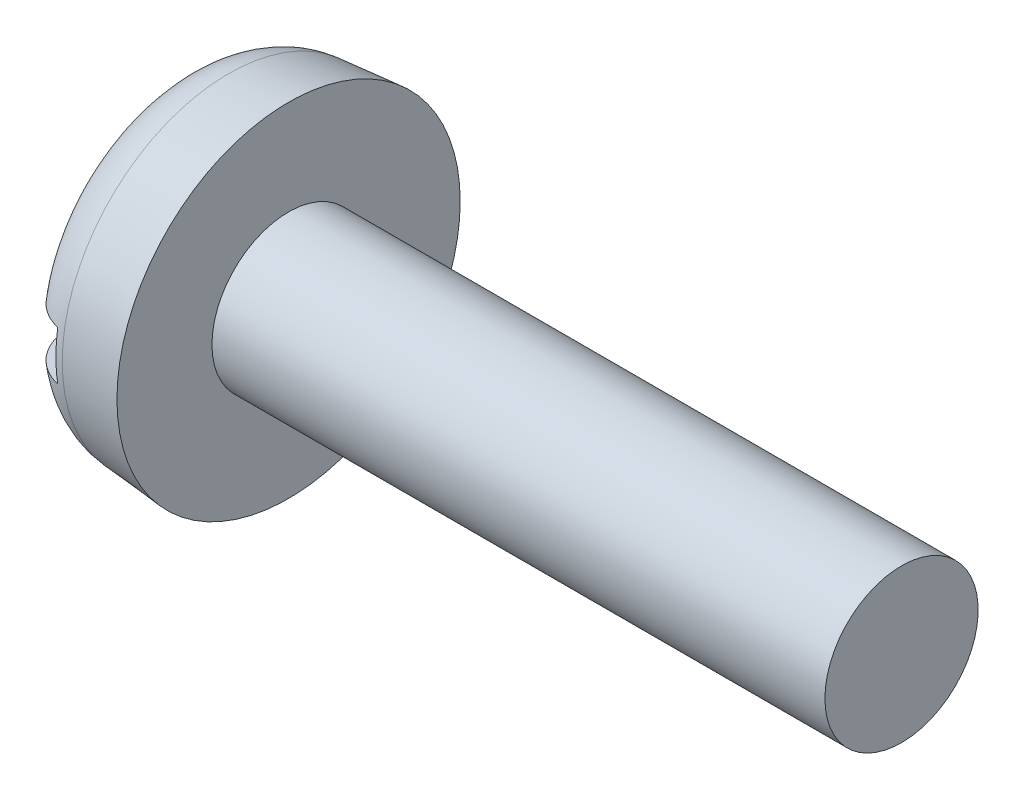
ISO-10303-21;
HEADER;
FILE_DESCRIPTION(('STEP AP214'),'2;1');
FILE_NAME('part.step','',(''),(''),'','','');
FILE_SCHEMA(('AUTOMOTIVE_DESIGN { 1 0 10303 214 1 1 1 1 }'));
ENDSEC;
DATA;
#1=APPLICATION_CONTEXT('core data for automotive mechanical design processes');
#2=APPLICATION_PROTOCOL_DEFINITION('international standard','automotive_design',2000,#1);
#3=PRODUCT_CONTEXT('',#1,'mechanical');
#4=PRODUCT('Part','Part','',(#3));
#5=PRODUCT_RELATED_PRODUCT_CATEGORY('part','',(#4));
#6=PRODUCT_DEFINITION_FORMATION('','',#4);
#7=PRODUCT_DEFINITION_CONTEXT('part definition',#1,'design');
#8=PRODUCT_DEFINITION('design','',#6,#7);
#9=PRODUCT_DEFINITION_SHAPE('','',#8);
#10=(LENGTH_UNIT() NAMED_UNIT(*) SI_UNIT(.MILLI.,.METRE.));
#11=(NAMED_UNIT(*) PLANE_ANGLE_UNIT() SI_UNIT($,.RADIAN.));
#12=(NAMED_UNIT(*) SI_UNIT($,.STERADIAN.) SOLID_ANGLE_UNIT());
#13=UNCERTAINTY_MEASURE_WITH_UNIT(LENGTH_MEASURE(1.E-05),#10,'distance_accuracy_value','');
#14=(GEOMETRIC_REPRESENTATION_CONTEXT(3) GLOBAL_UNCERTAINTY_ASSIGNED_CONTEXT((#13)) GLOBAL_UNIT_ASSIGNED_CONTEXT((#10,
#11,#12)) REPRESENTATION_CONTEXT('',''));
#15=CARTESIAN_POINT('',(0.,0.,0.));
#16=DIRECTION('',(0.,0.,1.));
#17=DIRECTION('',(1.,0.,0.));
#18=AXIS2_PLACEMENT_3D('',#15,#16,#17);
#19=CARTESIAN_POINT('',(0.,0.,0.));
#20=DIRECTION('',(-1.,0.,0.));
#21=DIRECTION('',(0.,0.,1.));
#22=AXIS2_PLACEMENT_3D('',#19,#20,#21);
#23=PLANE('',#22);
#24=DIRECTION('',(0.,0.,-1.));
#25=VECTOR('',#24,1.);
#26=CARTESIAN_POINT('',(0.,0.399999999999999,2.8));
#27=LINE('',#26,#25);
#28=CARTESIAN_POINT('',(0.,0.399999999999999,1.77326763142532));
#29=VERTEX_POINT('',#28);
#30=CARTESIAN_POINT('',(0.,0.399999999999999,-1.77326763142532));
#31=VERTEX_POINT('',#30);
#32=EDGE_CURVE('E90',#29,#31,#27,.T.);
#33=ORIENTED_EDGE('',*,*,#32,.F.);
#34=CARTESIAN_POINT('',(0.,0.,0.));
#35=DIRECTION('',(-1.,0.,0.));
#36=DIRECTION('',(0.,0.,1.));
#37=AXIS2_PLACEMENT_3D('',#34,#35,#36);
#38=CIRCLE('',#37,1.81782234903766);
#39=EDGE_CURVE('E96',#29,#31,#38,.T.);
#40=ORIENTED_EDGE('',*,*,#39,.T.);
#41=EDGE_LOOP('',(#33,#40));
#42=FACE_BOUND('',#41,.T.);
#43=ADVANCED_FACE('F37',(#42),#23,.T.);
#44=CARTESIAN_POINT('',(-25.4,0.,0.));
#45=DIRECTION('',(-1.,0.,0.));
#46=DIRECTION('',(0.,0.,1.));
#47=AXIS2_PLACEMENT_3D('',#44,#45,#46);
#48=CYLINDRICAL_SURFACE('',#47,1.25);
#49=CARTESIAN_POINT('',(11.8,0.,0.));
#50=DIRECTION('',(-1.,0.,0.));
#51=DIRECTION('',(0.,0.,1.));
#52=AXIS2_PLACEMENT_3D('',#49,#50,#51);
#53=CIRCLE('',#52,1.25);
#54=CARTESIAN_POINT('',(11.8,0.,1.25));
#55=VERTEX_POINT('',#54);
#56=EDGE_CURVE('E97',#55,#55,#53,.T.);
#57=ORIENTED_EDGE('',*,*,#56,.T.);
#58=EDGE_LOOP('',(#57));
#59=FACE_BOUND('',#58,.T.);
#60=CARTESIAN_POINT('',(1.8,0.,0.));
#61=DIRECTION('',(-1.,0.,0.));
#62=DIRECTION('',(0.,0.,1.));
#63=AXIS2_PLACEMENT_3D('',#60,#61,#62);
#64=CIRCLE('',#63,1.25);
#65=CARTESIAN_POINT('',(1.8,0.,1.25));
#66=VERTEX_POINT('',#65);
#67=EDGE_CURVE('E154',#66,#66,#64,.T.);
#68=ORIENTED_EDGE('',*,*,#67,.F.);
#69=EDGE_LOOP('',(#68));
#70=FACE_BOUND('',#69,.T.);
#71=ADVANCED_FACE('F142',(#59,#70),#48,.T.);
#72=CARTESIAN_POINT('',(11.8,1.25,0.));
#73=DIRECTION('',(1.,0.,0.));
#74=DIRECTION('',(0.,0.,-1.));
#75=AXIS2_PLACEMENT_3D('',#72,#73,#74);
#76=PLANE('',#75);
#77=ORIENTED_EDGE('',*,*,#56,.F.);
#78=EDGE_LOOP('',(#77));
#79=FACE_BOUND('',#78,.T.);
#80=ADVANCED_FACE('F140',(#79),#76,.T.);
#81=DIRECTION('',(0.,0.,1.));
#82=VECTOR('',#81,1.);
#83=CARTESIAN_POINT('',(0.,-0.4,-2.8));
#84=LINE('',#83,#82);
#85=CARTESIAN_POINT('',(0.,-0.4,-1.77326763142532));
#86=VERTEX_POINT('',#85);
#87=CARTESIAN_POINT('',(0.,-0.4,1.77326763142532));
#88=VERTEX_POINT('',#87);
#89=EDGE_CURVE('E81',#86,#88,#84,.T.);
#90=ORIENTED_EDGE('',*,*,#89,.F.);
#91=EDGE_CURVE('E88',#86,#88,#38,.T.);
#92=ORIENTED_EDGE('',*,*,#91,.T.);
#93=EDGE_LOOP('',(#90,#92));
#94=FACE_BOUND('',#93,.T.);
#95=ADVANCED_FACE('F87',(#94),#23,.T.);
#96=CARTESIAN_POINT('',(0.,0.,0.));
#97=DIRECTION('',(1.,0.,0.));
#98=DIRECTION('',(0.,0.,-1.));
#99=AXIS2_PLACEMENT_3D('',#96,#97,#98);
#100=CONICAL_SURFACE('',#99,2.64252040565334,0.087266462599717);
#101=CARTESIAN_POINT('',(0.821559831527107,0.,0.));
#102=DIRECTION('',(-1.,0.,0.));
#103=DIRECTION('',(0.,0.,1.));
#104=AXIS2_PLACEMENT_3D('',#101,#102,#103);
#105=CIRCLE('',#104,2.71439757732023);
#106=CARTESIAN_POINT('',(0.821559831527107,0.,2.71439757732023));
#107=VERTEX_POINT('',#106);
#108=EDGE_CURVE('E100',#107,#107,#105,.F.);
#109=ORIENTED_EDGE('',*,*,#108,.T.);
#110=EDGE_LOOP('',(#109));
#111=FACE_BOUND('',#110,.T.);
#112=CARTESIAN_POINT('',(1.8,0.,0.));
#113=DIRECTION('',(-1.,0.,0.));
#114=DIRECTION('',(0.,0.,1.));
#115=AXIS2_PLACEMENT_3D('',#112,#113,#114);
#116=CIRCLE('',#115,2.8);
#117=CARTESIAN_POINT('',(1.8,0.,2.8));
#118=VERTEX_POINT('',#117);
#119=EDGE_CURVE('E102',#118,#118,#116,.T.);
#120=ORIENTED_EDGE('',*,*,#119,.T.);
#121=EDGE_LOOP('',(#120));
#122=FACE_BOUND('',#121,.T.);
#123=ADVANCED_FACE('F133',(#111,#122),#100,.T.);
#124=CARTESIAN_POINT('',(1.8,1.25,0.));
#125=DIRECTION('',(-1.,0.,0.));
#126=DIRECTION('',(0.,0.,1.));
#127=AXIS2_PLACEMENT_3D('',#124,#125,#126);
#128=PLANE('',#127);
#129=ORIENTED_EDGE('',*,*,#119,.F.);
#130=EDGE_LOOP('',(#129));
#131=FACE_BOUND('',#130,.T.);
#132=ORIENTED_EDGE('',*,*,#67,.T.);
#133=EDGE_LOOP('',(#132));
#134=FACE_BOUND('',#133,.T.);
#135=ADVANCED_FACE('F129',(#131,#134),#128,.F.);
#136=CARTESIAN_POINT('',(0.9,0.,0.));
#137=DIRECTION('',(-1.,0.,0.));
#138=DIRECTION('',(0.,0.,1.));
#139=AXIS2_PLACEMENT_3D('',#136,#137,#138);
#140=TOROIDAL_SURFACE('',#139,1.81782234903766,0.9);
#141=CARTESIAN_POINT('',(0.285780762477817,0.399999999999999,-2.44311963508101));
#142=CARTESIAN_POINT('',(0.322325244969282,0.399999999999999,-2.47769297217772));
#143=CARTESIAN_POINT('',(0.361794878156767,0.399999999999999,-2.50922544126929));
#144=CARTESIAN_POINT('',(0.445493757535042,0.399999999999999,-2.56525291577746));
#145=CARTESIAN_POINT('',(0.48972822484029,0.399999999999999,-2.58974009118149));
#146=CARTESIAN_POINT('',(0.581685294636184,0.399999999999999,-2.63091846199156));
#147=CARTESIAN_POINT('',(0.629407305379897,0.399999999999999,-2.64761097641683));
#148=CARTESIAN_POINT('',(0.726972312257168,0.399999999999999,-2.67270033258514));
#149=CARTESIAN_POINT('',(0.776814803129367,0.399999999999999,-2.68109913910669));
#150=CARTESIAN_POINT('',(0.876977038697278,0.399999999999999,-2.68933922206438));
#151=CARTESIAN_POINT('',(0.92729364560996,0.399999999999999,-2.68921866149007));
#152=CARTESIAN_POINT('',(1.02719093347253,0.399999999999999,-2.68051830929739));
#153=CARTESIAN_POINT('',(1.07677160162593,0.399999999999999,-2.67193837076201));
#154=CARTESIAN_POINT('',(1.17371760664879,0.399999999999999,-2.6465919807109));
#155=CARTESIAN_POINT('',(1.2210859954371,0.399999999999999,-2.62983719558013));
#156=CARTESIAN_POINT('',(1.31235127069059,0.399999999999999,-2.58864040768255));
#157=CARTESIAN_POINT('',(1.35624813968071,0.399999999999999,-2.56419836622246));
#158=CARTESIAN_POINT('',(1.43950339303332,0.399999999999999,-2.50824069345436));
#159=CARTESIAN_POINT('',(1.47884484993389,0.399999999999999,-2.47669988555644));
#160=CARTESIAN_POINT('',(1.55173067508121,0.399999999999999,-2.40751412200212));
#161=CARTESIAN_POINT('',(1.5852748745774,0.399999999999999,-2.36986898871862));
#162=CARTESIAN_POINT('',(1.64594872274809,0.399999999999999,-2.28919528368316));
#163=CARTESIAN_POINT('',(1.67301846569636,0.399999999999999,-2.24612167422176));
#164=CARTESIAN_POINT('',(1.71966197411636,0.399999999999999,-2.15609376898817));
#165=CARTESIAN_POINT('',(1.73923530584546,0.399999999999999,-2.10913924885738));
#166=CARTESIAN_POINT('',(1.77066025907209,0.399999999999999,-2.01194193646076));
#167=CARTESIAN_POINT('',(1.78239254664628,0.399999999999999,-1.96166058810882));
#168=CARTESIAN_POINT('',(1.7974373595853,0.399999999999999,-1.85985639013623));
#169=CARTESIAN_POINT('',(1.80074908437145,0.399999999999999,-1.80833342293966));
#170=CARTESIAN_POINT('',(1.79894832980293,0.399999999999999,-1.70434405475568));
#171=CARTESIAN_POINT('',(1.79365584590562,0.399999999999999,-1.651880798299));
#172=CARTESIAN_POINT('',(1.77456092354076,0.399999999999999,-1.54852841034414));
#173=CARTESIAN_POINT('',(1.76075741543224,0.399999999999999,-1.49763947754675));
#174=CARTESIAN_POINT('',(1.7246504916629,0.399999999999999,-1.3975266769579));
#175=CARTESIAN_POINT('',(1.70214283236717,0.399999999999999,-1.34837644263265));
#176=CARTESIAN_POINT('',(1.64933120824444,0.399999999999999,-1.25444995564252));
#177=CARTESIAN_POINT('',(1.6190255468442,0.399999999999999,-1.20967465773975));
#178=CARTESIAN_POINT('',(1.55085214424215,0.399999999999999,-1.12504927254803));
#179=CARTESIAN_POINT('',(1.51286662510254,0.399999999999999,-1.08529386793689));
#180=CARTESIAN_POINT('',(1.4306134165613,0.399999999999999,-1.01288372669285));
#181=CARTESIAN_POINT('',(1.38634513970435,0.399999999999999,-0.980229654778111));
#182=CARTESIAN_POINT('',(1.29378824575784,0.399999999999999,-0.924048107397016));
#183=CARTESIAN_POINT('',(1.24562231583718,0.399999999999999,-0.900319541839471));
#184=CARTESIAN_POINT('',(1.14574424072186,0.399999999999999,-0.862177327128566));
#185=CARTESIAN_POINT('',(1.09403573066562,0.399999999999999,-0.847754283110135));
#186=CARTESIAN_POINT('',(0.993395643106034,0.399999999999999,-0.830011922353259));
#187=CARTESIAN_POINT('',(0.944615271160062,0.399999999999999,-0.825833796085957));
#188=CARTESIAN_POINT('',(0.847107354416666,0.399999999999999,-0.826334878356685));
#189=CARTESIAN_POINT('',(0.798379798268946,0.399999999999999,-0.831011470142969));
#190=CARTESIAN_POINT('',(0.705495670608723,0.399999999999999,-0.848340731069384));
#191=CARTESIAN_POINT('',(0.661242330843084,0.399999999999999,-0.860484898174224));
#192=CARTESIAN_POINT('',(0.575232402842408,0.399999999999999,-0.891650416332973));
#193=CARTESIAN_POINT('',(0.53347652813922,0.399999999999999,-0.910673721938904));
#194=CARTESIAN_POINT('',(0.451191926076945,0.399999999999999,-0.956010770911779));
#195=CARTESIAN_POINT('',(0.410848958567061,0.399999999999999,-0.982660648611481));
#196=CARTESIAN_POINT('',(0.334722321142852,0.399999999999999,-1.04182188589593));
#197=CARTESIAN_POINT('',(0.298940164912518,0.399999999999999,-1.0743351828853));
#198=CARTESIAN_POINT('',(0.229649980616187,0.399999999999999,-1.14749226888793));
#199=CARTESIAN_POINT('',(0.19663491483028,0.399999999999999,-1.18860403936715));
#200=CARTESIAN_POINT('',(0.137645150810003,0.399999999999999,-1.27560624817727));
#201=CARTESIAN_POINT('',(0.111672172806046,0.399999999999999,-1.32149785033543));
#202=CARTESIAN_POINT('',(0.0665593590158845,0.399999999999999,-1.41881690272049));
#203=CARTESIAN_POINT('',(0.0477401615322295,0.399999999999999,-1.47039354331754));
#204=CARTESIAN_POINT('',(0.0191028447664949,0.399999999999999,-1.57598967955257));
#205=CARTESIAN_POINT('',(0.0092842991143383,0.399999999999999,-1.63000905934828));
#206=CARTESIAN_POINT('',(-0.000908845669418229,0.399999999999999,-1.73850050809585));
#207=CARTESIAN_POINT('',(-0.00135843890630432,0.399999999999999,-1.7929654882335));
#208=CARTESIAN_POINT('',(0.00713794868793661,0.399999999999999,-1.90117587148683));
#209=CARTESIAN_POINT('',(0.0160852351491477,0.399999999999999,-1.9549211735574));
#210=CARTESIAN_POINT('',(0.0428869469078851,0.399999999999999,-2.05874477252473));
#211=CARTESIAN_POINT('',(0.0605196216319729,0.399999999999999,-2.10888044427302));
#212=CARTESIAN_POINT('',(0.104140493725079,0.399999999999999,-2.20532358851202));
#213=CARTESIAN_POINT('',(0.130117020588857,0.399999999999999,-2.25163629510255));
#214=CARTESIAN_POINT('',(0.178150945787741,0.399999999999999,-2.32211375046635));
#215=CARTESIAN_POINT('',(0.197843641859489,0.399999999999999,-2.34792122195273));
#216=CARTESIAN_POINT('',(0.239879292580621,0.399999999999999,-2.39728022756983));
#217=CARTESIAN_POINT('',(0.26222221206527,0.399999999999999,-2.42083179162577));
#218=CARTESIAN_POINT('',(0.285780762477817,0.399999999999999,-2.44311963508101));
#219=B_SPLINE_CURVE_WITH_KNOTS('',3,(#141,#142,#143,#144,#145,#146,#147,#148,#149,#150,#151,
#152,#153,#154,#155,#156,#157,#158,#159,#160,#161,#162,#163,#164,#165,#166,#167,#168,#169,#170,
#171,#172,#173,#174,#175,#176,#177,#178,#179,#180,#181,#182,#183,#184,#185,#186,#187,#188,#189,
#190,#191,#192,#193,#194,#195,#196,#197,#198,#199,#200,#201,#202,#203,#204,#205,#206,#207,#208,
#209,#210,#211,#212,#213,#214,#215,#216,#217,#218),.UNSPECIFIED.,.T.,.F.,(4,2,2,2,2,2,2,2,2,2,2,
2,2,2,2,2,2,2,2,2,2,2,2,2,2,2,2,2,2,2,2,2,2,2,2,2,2,2,4),(0.,0.15080428220943,0.301775523831159,
0.452721208703323,0.603631125974155,0.753865076726384,0.904101636690626,1.05412441728995,
1.2041479530309,1.35471219197995,1.50528081291863,1.65719291262943,1.80911380065295,
1.96329712022902,2.11749509812026,2.27496068670365,2.43244606914274,2.59387611122166,
2.75534130458713,2.9195015653164,3.08367718561128,3.24389389244898,3.40394859014677,
3.55004213794101,3.69609251881818,3.83315592967566,3.97025831464733,4.11470991133513,
4.25920932580005,4.41668805635775,4.57420522099047,4.73812462607052,4.90203626571949,
5.06463536051201,5.22725705028985,5.38592661841767,5.54437521558828,5.64159310397338,
5.73880970255809),.UNSPECIFIED.);
#220=CARTESIAN_POINT('',(0.7,0.399999999999999,-2.66547244738019));
#221=VERTEX_POINT('',#220);
#222=EDGE_CURVE('E11',#31,#221,#219,.T.);
#223=ORIENTED_EDGE('',*,*,#222,.F.);
#224=ORIENTED_EDGE('',*,*,#39,.F.);
#225=CARTESIAN_POINT('',(0.356169071138296,0.399999999999999,1.02545886384317));
#226=CARTESIAN_POINT('',(0.394477383289829,0.399999999999999,0.994276095963573));
#227=CARTESIAN_POINT('',(0.435252098816795,0.399999999999999,0.966090537778846));
#228=CARTESIAN_POINT('',(0.520874070068605,0.399999999999999,0.916713010685472));
#229=CARTESIAN_POINT('',(0.56572297498939,0.399999999999999,0.895523890103122));
#230=CARTESIAN_POINT('',(0.658585145836014,0.399999999999999,0.861072215462475));
#231=CARTESIAN_POINT('',(0.706609437889925,0.399999999999999,0.84783908573147));
#232=CARTESIAN_POINT('',(0.80424325350734,0.399999999999999,0.83024223356215));
#233=CARTESIAN_POINT('',(0.853851628876229,0.399999999999999,0.825872228699233));
#234=CARTESIAN_POINT('',(0.950010182321422,0.399999999999999,0.826277197704913));
#235=CARTESIAN_POINT('',(0.99656347412262,0.399999999999999,0.830513937244102));
#236=CARTESIAN_POINT('',(1.08828168676608,0.399999999999999,0.846797595491545));
#237=CARTESIAN_POINT('',(1.1334463088223,0.399999999999999,0.858846182848628));
#238=CARTESIAN_POINT('',(1.22099947575276,0.399999999999999,0.890027753500388));
#239=CARTESIAN_POINT('',(1.26339999097867,0.399999999999999,0.909127417221132));
#240=CARTESIAN_POINT('',(1.34475562295769,0.399999999999999,0.953613660794996));
#241=CARTESIAN_POINT('',(1.38370973618203,0.399999999999999,0.979002063689565));
#242=CARTESIAN_POINT('',(1.4606297229717,0.399999999999999,1.03768873851847));
#243=CARTESIAN_POINT('',(1.49821861120609,0.399999999999999,1.07148126912978));
#244=CARTESIAN_POINT('',(1.56766557552966,0.399999999999999,1.14451739265722));
#245=CARTESIAN_POINT('',(1.59952174981566,0.399999999999999,1.18376278691406));
#246=CARTESIAN_POINT('',(1.65882951195037,0.399999999999999,1.26965174466254));
#247=CARTESIAN_POINT('',(1.68580874421987,0.399999999999999,1.3166225459502));
#248=CARTESIAN_POINT('',(1.7316261790846,0.399999999999999,1.41438438512647));
#249=CARTESIAN_POINT('',(1.7504634598458,0.399999999999999,1.46517585482832));
#250=CARTESIAN_POINT('',(1.77959171793735,0.399999999999999,1.56990546726));
#251=CARTESIAN_POINT('',(1.78976336496765,0.399999999999999,1.62387693551388));
#252=CARTESIAN_POINT('',(1.80070617985939,0.399999999999999,1.73276786407042));
#253=CARTESIAN_POINT('',(1.80147810121521,0.399999999999999,1.78768724803349));
#254=CARTESIAN_POINT('',(1.7935515731225,0.399999999999999,1.89576039323533));
#255=CARTESIAN_POINT('',(1.78503812714098,0.399999999999999,1.94892767588158));
#256=CARTESIAN_POINT('',(1.75897009134329,0.399999999999999,2.05299963181349));
#257=CARTESIAN_POINT('',(1.74141670948687,0.399999999999999,2.10390460641263));
#258=CARTESIAN_POINT('',(1.69825810143573,0.399999999999999,2.20064023444731));
#259=CARTESIAN_POINT('',(1.67286703477487,0.399999999999999,2.24656646381803));
#260=CARTESIAN_POINT('',(1.61458416704904,0.399999999999999,2.33338474929434));
#261=CARTESIAN_POINT('',(1.58169323312494,0.399999999999999,2.37427738654701));
#262=CARTESIAN_POINT('',(1.51007060998367,0.399999999999999,2.44900649357427));
#263=CARTESIAN_POINT('',(1.47146964140907,0.399999999999999,2.48296829636122));
#264=CARTESIAN_POINT('',(1.38904817001727,0.399999999999999,2.54382334084698));
#265=CARTESIAN_POINT('',(1.34522808158393,0.399999999999999,2.57071714318276));
#266=CARTESIAN_POINT('',(1.25424836231413,0.399999999999999,2.61630908807752));
#267=CARTESIAN_POINT('',(1.20714119293126,0.399999999999999,2.63511196373395));
#268=CARTESIAN_POINT('',(1.11042474691739,0.399999999999999,2.66447616047847));
#269=CARTESIAN_POINT('',(1.06081558875378,0.399999999999999,2.67503787139057));
#270=CARTESIAN_POINT('',(0.960893961973373,0.399999999999999,2.68755622717405));
#271=CARTESIAN_POINT('',(0.910589316471373,0.399999999999999,2.68957539390776));
#272=CARTESIAN_POINT('',(0.810358152757913,0.399999999999999,2.68512046084422));
#273=CARTESIAN_POINT('',(0.760431626986743,0.399999999999999,2.67864653130185));
#274=CARTESIAN_POINT('',(0.662478823238217,0.399999999999999,2.65741995217084));
#275=CARTESIAN_POINT('',(0.614448868329621,0.399999999999999,2.64268425826029));
#276=CARTESIAN_POINT('',(0.521534433162197,0.399999999999999,2.60538142887937));
#277=CARTESIAN_POINT('',(0.476649962619439,0.399999999999999,2.58281426921971));
#278=CARTESIAN_POINT('',(0.391148993047609,0.399999999999999,2.53043182461717));
#279=CARTESIAN_POINT('',(0.350545548527357,0.399999999999999,2.50059523892845));
#280=CARTESIAN_POINT('',(0.27487411765014,0.399999999999999,2.43457977439371));
#281=CARTESIAN_POINT('',(0.239806285839746,0.399999999999999,2.39840071853429));
#282=CARTESIAN_POINT('',(0.1758792791862,0.399999999999999,2.32042102737606));
#283=CARTESIAN_POINT('',(0.147073507775005,0.399999999999999,2.27857662814835));
#284=CARTESIAN_POINT('',(0.0967847753411475,0.399999999999999,2.19069995841567));
#285=CARTESIAN_POINT('',(0.07530224160311,0.399999999999999,2.14466744374764));
#286=CARTESIAN_POINT('',(0.0399276675747797,0.399999999999999,2.04903409979779));
#287=CARTESIAN_POINT('',(0.0261471165350435,0.399999999999999,1.99939205575588));
#288=CARTESIAN_POINT('',(0.00693602242391587,0.399999999999999,1.89852251200784));
#289=CARTESIAN_POINT('',(0.00150590448368245,0.399999999999999,1.84729493171548));
#290=CARTESIAN_POINT('',(-0.000985777473936844,0.399999999999999,1.74359522844075));
#291=CARTESIAN_POINT('',(0.00212519999965288,0.399999999999999,1.69111899279254));
#292=CARTESIAN_POINT('',(0.0168916821616579,0.399999999999999,1.58737297380086));
#293=CARTESIAN_POINT('',(0.0285499964789277,0.399999999999999,1.53610359288829));
#294=CARTESIAN_POINT('',(0.0604020950384819,0.399999999999999,1.43486374575567));
#295=CARTESIAN_POINT('',(0.080804315905155,0.399999999999999,1.38495893538538));
#296=CARTESIAN_POINT('',(0.129530825890043,0.399999999999999,1.28921347783136));
#297=CARTESIAN_POINT('',(0.157849403934622,0.399999999999999,1.24336993202389));
#298=CARTESIAN_POINT('',(0.213684916145749,0.399999999999999,1.16773658539622));
#299=CARTESIAN_POINT('',(0.239651023875377,0.399999999999999,1.13678903007943));
#300=CARTESIAN_POINT('',(0.29525297901351,0.399999999999999,1.07838116842152));
#301=CARTESIAN_POINT('',(0.324888803246328,0.399999999999999,1.05092084005941));
#302=CARTESIAN_POINT('',(0.356169071138296,0.399999999999999,1.02545886384317));
#303=B_SPLINE_CURVE_WITH_KNOTS('',3,(#225,#226,#227,#228,#229,#230,#231,#232,#233,#234,#235,
#236,#237,#238,#239,#240,#241,#242,#243,#244,#245,#246,#247,#248,#249,#250,#251,#252,#253,#254,
#255,#256,#257,#258,#259,#260,#261,#262,#263,#264,#265,#266,#267,#268,#269,#270,#271,#272,#273,
#274,#275,#276,#277,#278,#279,#280,#281,#282,#283,#284,#285,#286,#287,#288,#289,#290,#291,#292,
#293,#294,#295,#296,#297,#298,#299,#300,#301,#302),.UNSPECIFIED.,.T.,.F.,(4,2,2,2,2,2,2,2,2,2,2,
2,2,2,2,2,2,2,2,2,2,2,2,2,2,2,2,2,2,2,2,2,2,2,2,2,2,2,4),(0.,0.148056677712979,
0.296173556814866,0.444834912477076,0.593390856036848,0.732942639414739,0.87252424155987,
1.01145452751666,1.15042513517956,1.30141738715291,1.45245963818336,1.61420969223844,
1.7759780548859,1.93993961693164,2.10388803551639,2.26462860972824,2.42534771058163,
2.58201478455569,2.73866375372932,2.89216335268838,3.04565077231286,3.19708679229202,
3.34851564860216,3.49883427697698,3.64914989207022,3.79915813668078,3.94916684463061,
4.09962050651671,4.25007836811616,4.40177296660437,4.55347641441351,4.70732244078731,
4.86117629939849,5.0181609530014,5.17519723279955,5.33620557401864,5.49709805791682,
5.61799301592463,5.73888721047272),.UNSPECIFIED.);
#304=CARTESIAN_POINT('',(0.7,0.399999999999999,2.66547244738019));
#305=VERTEX_POINT('',#304);
#306=EDGE_CURVE('E114',#305,#29,#303,.T.);
#307=ORIENTED_EDGE('',*,*,#306,.F.);
#308=CARTESIAN_POINT('',(0.7,0.,0.));
#309=DIRECTION('',(-1.,0.,0.));
#310=DIRECTION('',(0.,0.,1.));
#311=AXIS2_PLACEMENT_3D('',#308,#309,#310);
#312=CIRCLE('',#311,2.69531878777687);
#313=CARTESIAN_POINT('',(0.7,-0.4,2.66547244738019));
#314=VERTEX_POINT('',#313);
#315=EDGE_CURVE('E108',#305,#314,#312,.F.);
#316=ORIENTED_EDGE('',*,*,#315,.T.);
#317=CARTESIAN_POINT('',(0.356169071138295,-0.4,1.02545886384317));
#318=CARTESIAN_POINT('',(0.314031332279046,-0.4,1.05976167261355));
#319=CARTESIAN_POINT('',(0.274819372687131,-0.4,1.0977427449374));
#320=CARTESIAN_POINT('',(0.20326819432942,-0.4,1.17978565669674));
#321=CARTESIAN_POINT('',(0.170942545508555,-0.4,1.22385922524595));
#322=CARTESIAN_POINT('',(0.114111407238762,-0.4,1.31672727393884));
#323=CARTESIAN_POINT('',(0.0895968760226379,-0.4,1.36551620987613));
#324=CARTESIAN_POINT('',(0.0490785202121342,-0.4,1.46648183341045));
#325=CARTESIAN_POINT('',(0.0330703604686471,-0.4,1.51865678013273));
#326=CARTESIAN_POINT('',(0.0100453697545739,-0.4,1.62518908376032));
#327=CARTESIAN_POINT('',(0.00306618218707072,-0.4,1.67955460937645));
#328=CARTESIAN_POINT('',(-0.00144685561490153,-0.4,1.78868546318226));
#329=CARTESIAN_POINT('',(0.00101939609011318,-0.4,1.84345079568049));
#330=CARTESIAN_POINT('',(0.0152891480749748,-0.4,1.95052330416009));
#331=CARTESIAN_POINT('',(0.0268854930795697,-0.4,2.0028580557661));
#332=CARTESIAN_POINT('',(0.0589248901673074,-0.4,2.10474672243029));
#333=CARTESIAN_POINT('',(0.0793666318053631,-0.4,2.15430104818042));
#334=CARTESIAN_POINT('',(0.12795627217374,-0.4,2.24792186385266));
#335=CARTESIAN_POINT('',(0.155901237504733,-0.4,2.29209371256844));
#336=CARTESIAN_POINT('',(0.218944857951456,-0.4,2.37499861286517));
#337=CARTESIAN_POINT('',(0.254042725445854,-0.4,2.41373226246544));
#338=CARTESIAN_POINT('',(0.32966685096813,-0.4,2.48389534278566));
#339=CARTESIAN_POINT('',(0.370077637452012,-0.4,2.51544927894014));
#340=CARTESIAN_POINT('',(0.455677448683675,-0.4,2.57122459505542));
#341=CARTESIAN_POINT('',(0.500866128165061,-0.4,2.59544650436481));
#342=CARTESIAN_POINT('',(0.59413782417454,-0.4,2.6355729416184));
#343=CARTESIAN_POINT('',(0.642178527071038,-0.4,2.65157587103637));
#344=CARTESIAN_POINT('',(0.740273420359947,-0.4,2.67523109383666));
#345=CARTESIAN_POINT('',(0.790327524333046,-0.4,2.68288374523438));
#346=CARTESIAN_POINT('',(0.890686133385994,-0.4,2.68958762962226));
#347=CARTESIAN_POINT('',(0.940986998851127,-0.4,2.68869347246838));
#348=CARTESIAN_POINT('',(1.04072178380744,-0.4,2.67846167879018));
#349=CARTESIAN_POINT('',(1.0901557170213,-0.4,2.66912417603886));
#350=CARTESIAN_POINT('',(1.18669599164727,-0.4,2.64229877559468));
#351=CARTESIAN_POINT('',(1.23380501833184,-0.4,2.6248205362643));
#352=CARTESIAN_POINT('',(1.32443528846507,-0.4,2.58223220159563));
#353=CARTESIAN_POINT('',(1.36795650500275,-0.4,2.5571220490195));
#354=CARTESIAN_POINT('',(1.45036421793263,-0.4,2.49989362614525));
#355=CARTESIAN_POINT('',(1.48923230512215,-0.4,2.46774885590998));
#356=CARTESIAN_POINT('',(1.56107927302393,-0.4,2.39744378923729));
#357=CARTESIAN_POINT('',(1.59405796507024,-0.4,2.35928330016087));
#358=CARTESIAN_POINT('',(1.65352847250663,-0.4,2.2776666814067));
#359=CARTESIAN_POINT('',(1.67995797143492,-0.4,2.23416516156708));
#360=CARTESIAN_POINT('',(1.72526137908633,-0.4,2.14339421504174));
#361=CARTESIAN_POINT('',(1.74413484906926,-0.4,2.09612456975119));
#362=CARTESIAN_POINT('',(1.77411508290512,-0.4,1.9983989612356));
#363=CARTESIAN_POINT('',(1.78509960932637,-0.4,1.9479055243096));
#364=CARTESIAN_POINT('',(1.79862667184961,-0.4,1.84580292273346));
#365=CARTESIAN_POINT('',(1.80116838107033,-0.4,1.79419364929756));
#366=CARTESIAN_POINT('',(1.79780993826834,-0.4,1.69014314952536));
#367=CARTESIAN_POINT('',(1.79172746900389,-0.4,1.63770783465182));
#368=CARTESIAN_POINT('',(1.77106806778027,-0.4,1.53454005861514));
#369=CARTESIAN_POINT('',(1.75649007103968,-0.4,1.48380781174802));
#370=CARTESIAN_POINT('',(1.7188487103298,-0.4,1.38413781596447));
#371=CARTESIAN_POINT('',(1.69558194660123,-0.4,1.33527684770509));
#372=CARTESIAN_POINT('',(1.64130257902653,-0.4,1.24205401456033));
#373=CARTESIAN_POINT('',(1.6102882125599,-0.4,1.19769317671197));
#374=CARTESIAN_POINT('',(1.54078360718032,-0.4,1.11407031283595));
#375=CARTESIAN_POINT('',(1.50218355419827,-0.4,1.07489936013486));
#376=CARTESIAN_POINT('',(1.418793823597,-0.4,1.00377929202409));
#377=CARTESIAN_POINT('',(1.37400377230517,-0.4,0.971830612909673));
#378=CARTESIAN_POINT('',(1.28066227969846,-0.4,0.917245549760186));
#379=CARTESIAN_POINT('',(1.23224470963451,-0.4,0.894381439836963));
#380=CARTESIAN_POINT('',(1.13202516716603,-0.4,0.858023892867301));
#381=CARTESIAN_POINT('',(1.08022692076976,-0.4,0.844520323748755));
#382=CARTESIAN_POINT('',(0.979686768939645,-0.4,0.828554710074538));
#383=CARTESIAN_POINT('',(0.93108358272059,-0.4,0.82521631591368));
#384=CARTESIAN_POINT('',(0.834057576527117,-0.4,0.827306267768066));
#385=CARTESIAN_POINT('',(0.785634764475607,-0.4,0.832734994430688));
#386=CARTESIAN_POINT('',(0.693219129123407,-0.4,0.851440182721389));
#387=CARTESIAN_POINT('',(0.6491307615266,-0.4,0.864254528165209));
#388=CARTESIAN_POINT('',(0.563580966367806,-0.4,0.896690334746237));
#389=CARTESIAN_POINT('',(0.522117110679347,-0.4,0.916305391888431));
#390=CARTESIAN_POINT('',(0.460201335026828,-0.4,0.951554535089635));
#391=CARTESIAN_POINT('',(0.438547037771903,-0.4,0.965129512636783));
#392=CARTESIAN_POINT('',(0.396436028831445,-0.4,0.994018383793285));
#393=CARTESIAN_POINT('',(0.375979221006585,-0.4,1.00933213751563));
#394=CARTESIAN_POINT('',(0.356169071138295,-0.4,1.02545886384317));
#395=B_SPLINE_CURVE_WITH_KNOTS('',3,(#317,#318,#319,#320,#321,#322,#323,#324,#325,#326,#327,
#328,#329,#330,#331,#332,#333,#334,#335,#336,#337,#338,#339,#340,#341,#342,#343,#344,#345,#346,
#347,#348,#349,#350,#351,#352,#353,#354,#355,#356,#357,#358,#359,#360,#361,#362,#363,#364,#365,
#366,#367,#368,#369,#370,#371,#372,#373,#374,#375,#376,#377,#378,#379,#380,#381,#382,#383,#384,
#385,#386,#387,#388,#389,#390,#391,#392,#393,#394),.UNSPECIFIED.,.T.,.F.,(4,2,2,2,2,2,2,2,2,2,2,
2,2,2,2,2,2,2,2,2,2,2,2,2,2,2,2,2,2,2,2,2,2,2,2,2,2,2,4),(0.,0.162908543977831,
0.326135200101453,0.489172220791498,0.652126072139756,0.815757140806174,0.979389975458609,
1.13941349616251,1.29941331750199,1.45545894016543,1.61148738958683,1.76455910424509,
1.91761976498379,2.068802492645,2.21997873814259,2.37018969158947,2.52039826519579,
2.67042907998157,2.82046101999671,2.97106818075077,3.12168016531919,3.27367450756494,
3.42567767407005,3.5799880622519,3.73431356299688,3.89195060675763,4.04960741210517,
4.2112132976058,4.37285598283535,4.53703863620331,4.70123120514445,4.86099956435944,
5.02059471531597,5.16597452097209,5.31136063884072,5.44850857150574,5.58552770590542,
5.66212180496716,5.73870974628516),.UNSPECIFIED.);
#396=EDGE_CURVE('E95',#88,#314,#395,.T.);
#397=ORIENTED_EDGE('',*,*,#396,.F.);
#398=ORIENTED_EDGE('',*,*,#91,.F.);
#399=CARTESIAN_POINT('',(0.285780762477817,-0.4,-2.44311963508101));
#400=CARTESIAN_POINT('',(0.248557143829483,-0.4,-2.4078972812164));
#401=CARTESIAN_POINT('',(0.214312452361191,-0.4,-2.3694650707352));
#402=CARTESIAN_POINT('',(0.152768043532584,-0.4,-2.28733938194963));
#403=CARTESIAN_POINT('',(0.125478130377416,-0.4,-2.24363860286105));
#404=CARTESIAN_POINT('',(0.0786257158649477,-0.4,-2.15234079857027));
#405=CARTESIAN_POINT('',(0.0590537929026405,-0.4,-2.10474861000723));
#406=CARTESIAN_POINT('',(0.0280650821156157,-0.4,-2.00700047851119));
#407=CARTESIAN_POINT('',(0.0166461813020744,-0.4,-1.95684520345737));
#408=CARTESIAN_POINT('',(0.00206923204411929,-0.4,-1.85464080389292));
#409=CARTESIAN_POINT('',(-0.000972085111053079,-0.4,-1.80257506295451));
#410=CARTESIAN_POINT('',(0.00151453147792944,-0.4,-1.69864852440772));
#411=CARTESIAN_POINT('',(0.00704382880236603,-0.4,-1.64678776072725));
#412=CARTESIAN_POINT('',(0.0266516864050343,-0.4,-1.5434240201059));
#413=CARTESIAN_POINT('',(0.0409314131746847,-0.4,-1.49195921679783));
#414=CARTESIAN_POINT('',(0.0777275151672631,-0.4,-1.39206285915813));
#415=CARTESIAN_POINT('',(0.100245079836245,-0.4,-1.34363174403842));
#416=CARTESIAN_POINT('',(0.153482972183088,-0.4,-1.2500005252344));
#417=CARTESIAN_POINT('',(0.184382352554497,-0.4,-1.20490211419648));
#418=CARTESIAN_POINT('',(0.253306595403158,-0.4,-1.12049761259773));
#419=CARTESIAN_POINT('',(0.29133345875337,-0.4,-1.08119315410127));
#420=CARTESIAN_POINT('',(0.373599819825438,-0.4,-1.00962170698056));
#421=CARTESIAN_POINT('',(0.417845144124488,-0.4,-0.977361391817104));
#422=CARTESIAN_POINT('',(0.511393224424661,-0.4,-0.921257408160295));
#423=CARTESIAN_POINT('',(0.560693424544354,-0.4,-0.897409512943095));
#424=CARTESIAN_POINT('',(0.659899494014214,-0.4,-0.86056620148907));
#425=CARTESIAN_POINT('',(0.709596655508471,-0.4,-0.847011806093055));
#426=CARTESIAN_POINT('',(0.81063175641273,-0.4,-0.829407026781007));
#427=CARTESIAN_POINT('',(0.861968199741099,-0.4,-0.825348214635539));
#428=CARTESIAN_POINT('',(0.959752077480287,-0.4,-0.82693832731787));
#429=CARTESIAN_POINT('',(1.00621575887747,-0.4,-0.831730406017744));
#430=CARTESIAN_POINT('',(1.09766854953413,-0.4,-0.849077179323799));
#431=CARTESIAN_POINT('',(1.14265739171951,-0.4,-0.861633271803835));
#432=CARTESIAN_POINT('',(1.2299114176728,-0.4,-0.893807868219966));
#433=CARTESIAN_POINT('',(1.27218175788193,-0.4,-0.913412506998421));
#434=CARTESIAN_POINT('',(1.35320643219735,-0.4,-0.958874855551496));
#435=CARTESIAN_POINT('',(1.39195973961517,-0.4,-0.984734383223624));
#436=CARTESIAN_POINT('',(1.46843970297676,-0.4,-1.04440221898529));
#437=CARTESIAN_POINT('',(1.5057776319984,-0.4,-1.07870901508261));
#438=CARTESIAN_POINT('',(1.57463408911242,-0.4,-1.15273784634507));
#439=CARTESIAN_POINT('',(1.60615068897795,-0.4,-1.19246166827117));
#440=CARTESIAN_POINT('',(1.66460952025841,-0.4,-1.27921419766999));
#441=CARTESIAN_POINT('',(1.69108592858502,-0.4,-1.32655784594954));
#442=CARTESIAN_POINT('',(1.73582713929311,-0.4,-1.42498260596115));
#443=CARTESIAN_POINT('',(1.75409110005355,-0.4,-1.47606410012853));
#444=CARTESIAN_POINT('',(1.7819800651308,-0.4,-1.58118959955467));
#445=CARTESIAN_POINT('',(1.79150042969761,-0.4,-1.63526148025197));
#446=CARTESIAN_POINT('',(1.80112725488866,-0.4,-1.74424014808114));
#447=CARTESIAN_POINT('',(1.80123449731023,-0.4,-1.79914686549765));
#448=CARTESIAN_POINT('',(1.79200090917881,-0.4,-1.90704889801334));
#449=CARTESIAN_POINT('',(1.78285023172313,-0.4,-1.96006044029451));
#450=CARTESIAN_POINT('',(1.75554489311913,-0.4,-2.06371351442585));
#451=CARTESIAN_POINT('',(1.73739144905737,-0.4,-2.11435536562276));
#452=CARTESIAN_POINT('',(1.69310212999213,-0.4,-2.21047686976185));
#453=CARTESIAN_POINT('',(1.66717834059447,-0.4,-2.25605427430112));
#454=CARTESIAN_POINT('',(1.60789945686383,-0.4,-2.34209023989538));
#455=CARTESIAN_POINT('',(1.57454519739076,-0.4,-2.38254937521993));
#456=CARTESIAN_POINT('',(1.50207992140168,-0.4,-2.45635864078367));
#457=CARTESIAN_POINT('',(1.46309647311969,-0.4,-2.48983406282631));
#458=CARTESIAN_POINT('',(1.37999946341266,-0.4,-2.54966020191344));
#459=CARTESIAN_POINT('',(1.33588629200968,-0.4,-2.57601146011503));
#460=CARTESIAN_POINT('',(1.24441048294308,-0.4,-2.6204920842224));
#461=CARTESIAN_POINT('',(1.19709806498187,-0.4,-2.63872477396665));
#462=CARTESIAN_POINT('',(1.10007286159794,-0.4,-2.66692299241135));
#463=CARTESIAN_POINT('',(1.05036028930681,-0.4,-2.67688925373976));
#464=CARTESIAN_POINT('',(0.950330778412723,-0.4,-2.68821568147498));
#465=CARTESIAN_POINT('',(0.900020830724848,-0.4,-2.68963769422185));
#466=CARTESIAN_POINT('',(0.799864722777444,-0.4,-2.68399705480249));
#467=CARTESIAN_POINT('',(0.75001868033432,-0.4,-2.67693230351107));
#468=CARTESIAN_POINT('',(0.652295079642406,-0.4,-2.6545442288954));
#469=CARTESIAN_POINT('',(0.6044149380796,-0.4,-2.63923214293824));
#470=CARTESIAN_POINT('',(0.511939743577345,-0.4,-2.60081753553039));
#471=CARTESIAN_POINT('',(0.467340561615686,-0.4,-2.5777250172516));
#472=CARTESIAN_POINT('',(0.40010178523843,-0.4,-2.53543999984867));
#473=CARTESIAN_POINT('',(0.375979970292488,-0.4,-2.51855507086787));
#474=CARTESIAN_POINT('',(0.329505055171141,-0.4,-2.48250598020391));
#475=CARTESIAN_POINT('',(0.307151944649363,-0.4,-2.46334183185513));
#476=CARTESIAN_POINT('',(0.285780762477817,-0.4,-2.44311963508101));
#477=B_SPLINE_CURVE_WITH_KNOTS('',3,(#399,#400,#401,#402,#403,#404,#405,#406,#407,#408,#409,
#410,#411,#412,#413,#414,#415,#416,#417,#418,#419,#420,#421,#422,#423,#424,#425,#426,#427,#428,
#429,#430,#431,#432,#433,#434,#435,#436,#437,#438,#439,#440,#441,#442,#443,#444,#445,#446,#447,
#448,#449,#450,#451,#452,#453,#454,#455,#456,#457,#458,#459,#460,#461,#462,#463,#464,#465,#466,
#467,#468,#469,#470,#471,#472,#473,#474,#475,#476),.UNSPECIFIED.,.T.,.F.,(4,2,2,2,2,2,2,2,2,2,2,
2,2,2,2,2,2,2,2,2,2,2,2,2,2,2,2,2,2,2,2,2,2,2,2,2,2,2,4),(0.,0.153630076563003,0.30747554336492,
0.461132620212027,0.614749859849374,0.770496992161263,0.926268906303977,1.08576372212915,
1.24528157620828,1.40851960556979,1.57180352898442,1.73524147908282,1.89859719430262,
2.05228040591997,2.205827157294,2.34528036488284,2.48475868767391,2.62396413120246,
2.7632100815968,2.91467905032863,3.06619810123316,3.22817436288511,3.39016722026913,
3.55407439716564,3.71796796090444,3.87856222841603,4.03913479105936,4.19567175163465,
4.35219113316334,4.50560019509845,4.65899760068397,4.81038266514853,4.96175431138951,
5.1120289424741,5.26234075029904,5.41244826767269,5.56236352612232,5.65056762019062,
5.73877119825418),.UNSPECIFIED.);
#478=CARTESIAN_POINT('',(0.7,-0.4,-2.66547244738019));
#479=VERTEX_POINT('',#478);
#480=EDGE_CURVE('E49',#479,#86,#477,.T.);
#481=ORIENTED_EDGE('',*,*,#480,.F.);
#482=EDGE_CURVE('E61',#479,#221,#312,.F.);
#483=ORIENTED_EDGE('',*,*,#482,.T.);
#484=EDGE_LOOP('',(#223,#224,#307,#316,#397,#398,#481,#483));
#485=FACE_BOUND('',#484,.T.);
#486=ORIENTED_EDGE('',*,*,#108,.F.);
#487=EDGE_LOOP('',(#486));
#488=FACE_BOUND('',#487,.T.);
#489=ADVANCED_FACE('F39',(#485,#488),#140,.T.);
#490=CARTESIAN_POINT('',(0.7,0.399999999999999,2.8));
#491=DIRECTION('',(0.,1.,0.));
#492=DIRECTION('',(0.,0.,1.));
#493=AXIS2_PLACEMENT_3D('',#490,#491,#492);
#494=PLANE('',#493);
#495=ORIENTED_EDGE('',*,*,#222,.T.);
#496=DIRECTION('',(0.,0.,-1.));
#497=VECTOR('',#496,1.);
#498=CARTESIAN_POINT('',(0.7,0.399999999999999,2.8));
#499=LINE('',#498,#497);
#500=EDGE_CURVE('E89',#305,#221,#499,.T.);
#501=ORIENTED_EDGE('',*,*,#500,.F.);
#502=ORIENTED_EDGE('',*,*,#306,.T.);
#503=ORIENTED_EDGE('',*,*,#32,.T.);
#504=EDGE_LOOP('',(#495,#501,#502,#503));
#505=FACE_BOUND('',#504,.T.);
#506=ADVANCED_FACE('F121',(#505),#494,.F.);
#507=CARTESIAN_POINT('',(0.7,-0.4,-2.8));
#508=DIRECTION('',(0.,-1.,0.));
#509=DIRECTION('',(0.,0.,-1.));
#510=AXIS2_PLACEMENT_3D('',#507,#508,#509);
#511=PLANE('',#510);
#512=ORIENTED_EDGE('',*,*,#480,.T.);
#513=ORIENTED_EDGE('',*,*,#89,.T.);
#514=ORIENTED_EDGE('',*,*,#396,.T.);
#515=DIRECTION('',(0.,0.,1.));
#516=VECTOR('',#515,1.);
#517=CARTESIAN_POINT('',(0.7,-0.4,-2.8));
#518=LINE('',#517,#516);
#519=EDGE_CURVE('E56',#479,#314,#518,.T.);
#520=ORIENTED_EDGE('',*,*,#519,.F.);
#521=EDGE_LOOP('',(#512,#513,#514,#520));
#522=FACE_BOUND('',#521,.T.);
#523=ADVANCED_FACE('F80',(#522),#511,.F.);
#524=CARTESIAN_POINT('',(0.7,0.399999999999999,-2.8));
#525=DIRECTION('',(-1.,0.,0.));
#526=DIRECTION('',(0.,0.,1.));
#527=AXIS2_PLACEMENT_3D('',#524,#525,#526);
#528=PLANE('',#527);
#529=ORIENTED_EDGE('',*,*,#519,.T.);
#530=ORIENTED_EDGE('',*,*,#315,.F.);
#531=ORIENTED_EDGE('',*,*,#500,.T.);
#532=ORIENTED_EDGE('',*,*,#482,.F.);
#533=EDGE_LOOP('',(#529,#530,#531,#532));
#534=FACE_BOUND('',#533,.T.);
#535=ADVANCED_FACE('F120',(#534),#528,.T.);
#536=CLOSED_SHELL('',(#43,#71,#80,#95,#123,#135,#489,#506,#523,#535));
#537=MANIFOLD_SOLID_BREP('B2',#536);
#538=ADVANCED_BREP_SHAPE_REPRESENTATION('',(#18,#537),#14);
#539=SHAPE_DEFINITION_REPRESENTATION(#9,#538);
ENDSEC;
END-ISO-10303-21;
